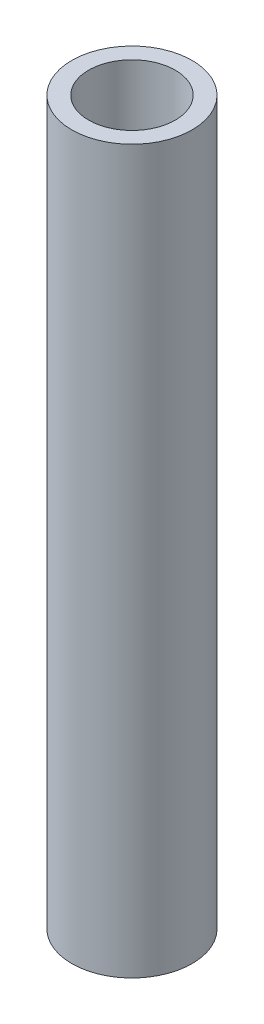
ISO-10303-21;
HEADER;
FILE_DESCRIPTION(('STEP AP214'),'2;1');
FILE_NAME('part.step','',(''),(''),'','','');
FILE_SCHEMA(('AUTOMOTIVE_DESIGN { 1 0 10303 214 1 1 1 1 }'));
ENDSEC;
DATA;
#1=APPLICATION_CONTEXT('core data for automotive mechanical design processes');
#2=APPLICATION_PROTOCOL_DEFINITION('international standard','automotive_design',2000,#1);
#3=PRODUCT_CONTEXT('',#1,'mechanical');
#4=PRODUCT('Part','Part','',(#3));
#5=PRODUCT_RELATED_PRODUCT_CATEGORY('part','',(#4));
#6=PRODUCT_DEFINITION_FORMATION('','',#4);
#7=PRODUCT_DEFINITION_CONTEXT('part definition',#1,'design');
#8=PRODUCT_DEFINITION('design','',#6,#7);
#9=PRODUCT_DEFINITION_SHAPE('','',#8);
#10=(LENGTH_UNIT() NAMED_UNIT(*) SI_UNIT(.MILLI.,.METRE.));
#11=(NAMED_UNIT(*) PLANE_ANGLE_UNIT() SI_UNIT($,.RADIAN.));
#12=(NAMED_UNIT(*) SI_UNIT($,.STERADIAN.) SOLID_ANGLE_UNIT());
#13=UNCERTAINTY_MEASURE_WITH_UNIT(LENGTH_MEASURE(1.E-05),#10,'distance_accuracy_value','');
#14=(GEOMETRIC_REPRESENTATION_CONTEXT(3) GLOBAL_UNCERTAINTY_ASSIGNED_CONTEXT((#13)) GLOBAL_UNIT_ASSIGNED_CONTEXT((#10,
#11,#12)) REPRESENTATION_CONTEXT('',''));
#15=CARTESIAN_POINT('',(0.,0.,0.));
#16=DIRECTION('',(0.,0.,1.));
#17=DIRECTION('',(1.,0.,0.));
#18=AXIS2_PLACEMENT_3D('',#15,#16,#17);
#19=CARTESIAN_POINT('',(0.,38.1,0.));
#20=DIRECTION('',(0.,1.,0.));
#21=DIRECTION('',(0.,0.,1.));
#22=AXIS2_PLACEMENT_3D('',#19,#20,#21);
#23=PLANE('',#22);
#24=CARTESIAN_POINT('',(0.,38.1,0.));
#25=DIRECTION('',(0.,1.,0.));
#26=DIRECTION('',(0.,0.,1.));
#27=AXIS2_PLACEMENT_3D('',#24,#25,#26);
#28=CIRCLE('',#27,3.175);
#29=CARTESIAN_POINT('',(0.,38.1,3.175));
#30=VERTEX_POINT('',#29);
#31=EDGE_CURVE('E10',#30,#30,#28,.T.);
#32=ORIENTED_EDGE('',*,*,#31,.T.);
#33=EDGE_LOOP('',(#32));
#34=FACE_BOUND('',#33,.T.);
#35=CARTESIAN_POINT('',(0.,38.1,0.));
#36=DIRECTION('',(0.,1.,0.));
#37=DIRECTION('',(0.,0.,1.));
#38=AXIS2_PLACEMENT_3D('',#35,#36,#37);
#39=CIRCLE('',#38,2.286);
#40=CARTESIAN_POINT('',(0.,38.1,2.286));
#41=VERTEX_POINT('',#40);
#42=EDGE_CURVE('E47',#41,#41,#39,.T.);
#43=ORIENTED_EDGE('',*,*,#42,.F.);
#44=EDGE_LOOP('',(#43));
#45=FACE_BOUND('',#44,.T.);
#46=ADVANCED_FACE('F36',(#34,#45),#23,.T.);
#47=CARTESIAN_POINT('',(0.,0.,0.));
#48=DIRECTION('',(0.,1.,0.));
#49=DIRECTION('',(0.,0.,1.));
#50=AXIS2_PLACEMENT_3D('',#47,#48,#49);
#51=PLANE('',#50);
#52=CARTESIAN_POINT('',(0.,0.,0.));
#53=DIRECTION('',(0.,1.,0.));
#54=DIRECTION('',(0.,0.,1.));
#55=AXIS2_PLACEMENT_3D('',#52,#53,#54);
#56=CIRCLE('',#55,3.175);
#57=CARTESIAN_POINT('',(0.,0.,3.175));
#58=VERTEX_POINT('',#57);
#59=EDGE_CURVE('E40',#58,#58,#56,.T.);
#60=ORIENTED_EDGE('',*,*,#59,.F.);
#61=EDGE_LOOP('',(#60));
#62=FACE_BOUND('',#61,.T.);
#63=CARTESIAN_POINT('',(0.,0.,0.));
#64=DIRECTION('',(0.,1.,0.));
#65=DIRECTION('',(0.,0.,1.));
#66=AXIS2_PLACEMENT_3D('',#63,#64,#65);
#67=CIRCLE('',#66,2.286);
#68=CARTESIAN_POINT('',(0.,0.,2.286));
#69=VERTEX_POINT('',#68);
#70=EDGE_CURVE('E49',#69,#69,#67,.T.);
#71=ORIENTED_EDGE('',*,*,#70,.T.);
#72=EDGE_LOOP('',(#71));
#73=FACE_BOUND('',#72,.T.);
#74=ADVANCED_FACE('F59',(#62,#73),#51,.F.);
#75=CARTESIAN_POINT('',(0.,38.1,0.));
#76=DIRECTION('',(0.,-1.,0.));
#77=DIRECTION('',(0.,0.,-1.));
#78=AXIS2_PLACEMENT_3D('',#75,#76,#77);
#79=CYLINDRICAL_SURFACE('',#78,3.175);
#80=ORIENTED_EDGE('',*,*,#31,.F.);
#81=EDGE_LOOP('',(#80));
#82=FACE_BOUND('',#81,.T.);
#83=ORIENTED_EDGE('',*,*,#59,.T.);
#84=EDGE_LOOP('',(#83));
#85=FACE_BOUND('',#84,.T.);
#86=ADVANCED_FACE('F38',(#82,#85),#79,.T.);
#87=CARTESIAN_POINT('',(0.,38.1,0.));
#88=DIRECTION('',(0.,-1.,0.));
#89=DIRECTION('',(0.,0.,-1.));
#90=AXIS2_PLACEMENT_3D('',#87,#88,#89);
#91=CYLINDRICAL_SURFACE('',#90,2.286);
#92=ORIENTED_EDGE('',*,*,#42,.T.);
#93=EDGE_LOOP('',(#92));
#94=FACE_BOUND('',#93,.T.);
#95=ORIENTED_EDGE('',*,*,#70,.F.);
#96=EDGE_LOOP('',(#95));
#97=FACE_BOUND('',#96,.T.);
#98=ADVANCED_FACE('F55',(#94,#97),#91,.F.);
#99=CLOSED_SHELL('',(#46,#74,#86,#98));
#100=MANIFOLD_SOLID_BREP('B2',#99);
#101=ADVANCED_BREP_SHAPE_REPRESENTATION('',(#18,#100),#14);
#102=SHAPE_DEFINITION_REPRESENTATION(#9,#101);
ENDSEC;
END-ISO-10303-21;
